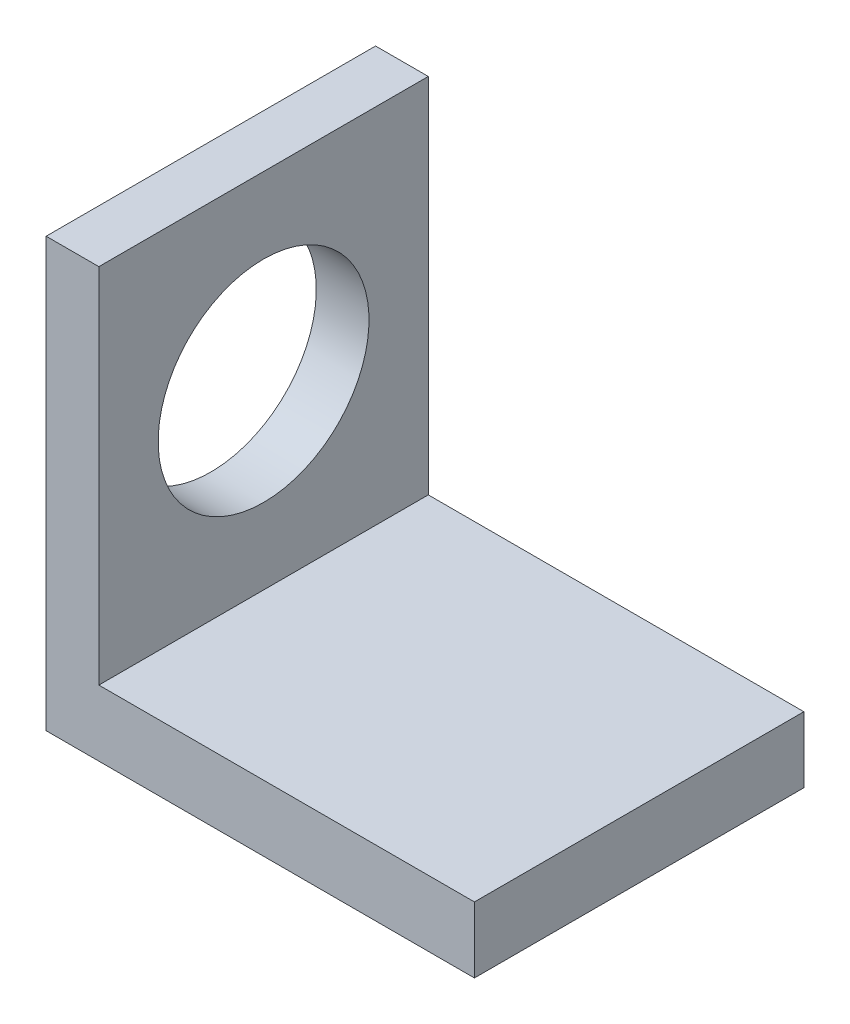
ISO-10303-21;
HEADER;
FILE_DESCRIPTION(('STEP AP214'),'2;1');
FILE_NAME('part.step','',(''),(''),'','','');
FILE_SCHEMA(('AUTOMOTIVE_DESIGN { 1 0 10303 214 1 1 1 1 }'));
ENDSEC;
DATA;
#1=APPLICATION_CONTEXT('core data for automotive mechanical design processes');
#2=APPLICATION_PROTOCOL_DEFINITION('international standard','automotive_design',2000,#1);
#3=PRODUCT_CONTEXT('',#1,'mechanical');
#4=PRODUCT('Part','Part','',(#3));
#5=PRODUCT_RELATED_PRODUCT_CATEGORY('part','',(#4));
#6=PRODUCT_DEFINITION_FORMATION('','',#4);
#7=PRODUCT_DEFINITION_CONTEXT('part definition',#1,'design');
#8=PRODUCT_DEFINITION('design','',#6,#7);
#9=PRODUCT_DEFINITION_SHAPE('','',#8);
#10=(LENGTH_UNIT() NAMED_UNIT(*) SI_UNIT(.MILLI.,.METRE.));
#11=(NAMED_UNIT(*) PLANE_ANGLE_UNIT() SI_UNIT($,.RADIAN.));
#12=(NAMED_UNIT(*) SI_UNIT($,.STERADIAN.) SOLID_ANGLE_UNIT());
#13=UNCERTAINTY_MEASURE_WITH_UNIT(LENGTH_MEASURE(1.E-05),#10,'distance_accuracy_value','');
#14=(GEOMETRIC_REPRESENTATION_CONTEXT(3) GLOBAL_UNCERTAINTY_ASSIGNED_CONTEXT((#13)) GLOBAL_UNIT_ASSIGNED_CONTEXT((#10,
#11,#12)) REPRESENTATION_CONTEXT('',''));
#15=CARTESIAN_POINT('',(0.,0.,0.));
#16=DIRECTION('',(0.,0.,1.));
#17=DIRECTION('',(1.,0.,0.));
#18=AXIS2_PLACEMENT_3D('',#15,#16,#17);
#19=CARTESIAN_POINT('',(0.,0.,-50.));
#20=DIRECTION('',(-1.,0.,0.));
#21=DIRECTION('',(0.,0.,1.));
#22=AXIS2_PLACEMENT_3D('',#19,#20,#21);
#23=PLANE('',#22);
#24=CARTESIAN_POINT('',(0.,37.5,-25.));
#25=DIRECTION('',(-1.,0.,0.));
#26=DIRECTION('',(0.,0.,1.));
#27=AXIS2_PLACEMENT_3D('',#24,#25,#26);
#28=CIRCLE('',#27,16.);
#29=CARTESIAN_POINT('',(0.,37.5,-9.));
#30=VERTEX_POINT('',#29);
#31=EDGE_CURVE('E122',#30,#30,#28,.T.);
#32=ORIENTED_EDGE('',*,*,#31,.F.);
#33=EDGE_LOOP('',(#32));
#34=FACE_BOUND('',#33,.T.);
#35=DIRECTION('',(0.,-1.,0.));
#36=VECTOR('',#35,1.);
#37=CARTESIAN_POINT('',(0.,0.,0.));
#38=LINE('',#37,#36);
#39=CARTESIAN_POINT('',(0.,65.,0.));
#40=VERTEX_POINT('',#39);
#41=CARTESIAN_POINT('',(0.,0.,0.));
#42=VERTEX_POINT('',#41);
#43=EDGE_CURVE('E118',#40,#42,#38,.T.);
#44=ORIENTED_EDGE('',*,*,#43,.F.);
#45=DIRECTION('',(0.,0.,1.));
#46=VECTOR('',#45,1.);
#47=CARTESIAN_POINT('',(0.,65.,-50.));
#48=LINE('',#47,#46);
#49=CARTESIAN_POINT('',(0.,65.,-50.));
#50=VERTEX_POINT('',#49);
#51=EDGE_CURVE('E11',#50,#40,#48,.T.);
#52=ORIENTED_EDGE('',*,*,#51,.F.);
#53=DIRECTION('',(0.,-1.,0.));
#54=VECTOR('',#53,1.);
#55=CARTESIAN_POINT('',(0.,0.,-50.));
#56=LINE('',#55,#54);
#57=CARTESIAN_POINT('',(0.,0.,-50.));
#58=VERTEX_POINT('',#57);
#59=EDGE_CURVE('E133',#50,#58,#56,.T.);
#60=ORIENTED_EDGE('',*,*,#59,.T.);
#61=DIRECTION('',(0.,0.,1.));
#62=VECTOR('',#61,1.);
#63=CARTESIAN_POINT('',(0.,0.,-50.));
#64=LINE('',#63,#62);
#65=EDGE_CURVE('E36',#58,#42,#64,.T.);
#66=ORIENTED_EDGE('',*,*,#65,.T.);
#67=EDGE_LOOP('',(#44,#52,#60,#66));
#68=FACE_BOUND('',#67,.T.);
#69=ADVANCED_FACE('F33',(#34,#68),#23,.T.);
#70=CARTESIAN_POINT('',(0.,65.,-50.));
#71=DIRECTION('',(0.,1.,0.));
#72=DIRECTION('',(0.,0.,1.));
#73=AXIS2_PLACEMENT_3D('',#70,#71,#72);
#74=PLANE('',#73);
#75=DIRECTION('',(-1.,0.,0.));
#76=VECTOR('',#75,1.);
#77=CARTESIAN_POINT('',(0.,65.,0.));
#78=LINE('',#77,#76);
#79=CARTESIAN_POINT('',(8.,65.,0.));
#80=VERTEX_POINT('',#79);
#81=EDGE_CURVE('E131',#80,#40,#78,.T.);
#82=ORIENTED_EDGE('',*,*,#81,.F.);
#83=DIRECTION('',(0.,0.,1.));
#84=VECTOR('',#83,1.);
#85=CARTESIAN_POINT('',(8.,65.,-50.));
#86=LINE('',#85,#84);
#87=CARTESIAN_POINT('',(8.,65.,-50.));
#88=VERTEX_POINT('',#87);
#89=EDGE_CURVE('E42',#88,#80,#86,.T.);
#90=ORIENTED_EDGE('',*,*,#89,.F.);
#91=DIRECTION('',(-1.,0.,0.));
#92=VECTOR('',#91,1.);
#93=CARTESIAN_POINT('',(0.,65.,-50.));
#94=LINE('',#93,#92);
#95=EDGE_CURVE('E108',#88,#50,#94,.T.);
#96=ORIENTED_EDGE('',*,*,#95,.T.);
#97=ORIENTED_EDGE('',*,*,#51,.T.);
#98=EDGE_LOOP('',(#82,#90,#96,#97));
#99=FACE_BOUND('',#98,.T.);
#100=ADVANCED_FACE('F141',(#99),#74,.T.);
#101=CARTESIAN_POINT('',(8.,65.,-50.));
#102=DIRECTION('',(1.,0.,0.));
#103=DIRECTION('',(0.,1.,0.));
#104=AXIS2_PLACEMENT_3D('',#101,#102,#103);
#105=PLANE('',#104);
#106=CARTESIAN_POINT('',(8.,37.5,-25.));
#107=DIRECTION('',(1.,0.,0.));
#108=DIRECTION('',(0.,1.,0.));
#109=AXIS2_PLACEMENT_3D('',#106,#107,#108);
#110=CIRCLE('',#109,16.);
#111=CARTESIAN_POINT('',(8.,53.5,-25.));
#112=VERTEX_POINT('',#111);
#113=EDGE_CURVE('E177',#112,#112,#110,.T.);
#114=ORIENTED_EDGE('',*,*,#113,.F.);
#115=EDGE_LOOP('',(#114));
#116=FACE_BOUND('',#115,.T.);
#117=DIRECTION('',(0.,1.,0.));
#118=VECTOR('',#117,1.);
#119=CARTESIAN_POINT('',(8.,65.,0.));
#120=LINE('',#119,#118);
#121=CARTESIAN_POINT('',(8.00000000000001,10.,0.));
#122=VERTEX_POINT('',#121);
#123=EDGE_CURVE('E95',#122,#80,#120,.T.);
#124=ORIENTED_EDGE('',*,*,#123,.F.);
#125=DIRECTION('',(0.,0.,1.));
#126=VECTOR('',#125,1.);
#127=CARTESIAN_POINT('',(8.00000000000001,10.,-50.));
#128=LINE('',#127,#126);
#129=CARTESIAN_POINT('',(8.00000000000001,10.,-50.));
#130=VERTEX_POINT('',#129);
#131=EDGE_CURVE('E90',#130,#122,#128,.T.);
#132=ORIENTED_EDGE('',*,*,#131,.F.);
#133=DIRECTION('',(0.,1.,0.));
#134=VECTOR('',#133,1.);
#135=CARTESIAN_POINT('',(8.,65.,-50.));
#136=LINE('',#135,#134);
#137=EDGE_CURVE('E93',#130,#88,#136,.T.);
#138=ORIENTED_EDGE('',*,*,#137,.T.);
#139=ORIENTED_EDGE('',*,*,#89,.T.);
#140=EDGE_LOOP('',(#124,#132,#138,#139));
#141=FACE_BOUND('',#140,.T.);
#142=ADVANCED_FACE('F92',(#116,#141),#105,.T.);
#143=CARTESIAN_POINT('',(8.00000000000001,10.,-50.));
#144=DIRECTION('',(0.,1.,0.));
#145=DIRECTION('',(-1.,0.,0.));
#146=AXIS2_PLACEMENT_3D('',#143,#144,#145);
#147=PLANE('',#146);
#148=DIRECTION('',(-1.,0.,0.));
#149=VECTOR('',#148,1.);
#150=CARTESIAN_POINT('',(8.00000000000001,10.,0.));
#151=LINE('',#150,#149);
#152=CARTESIAN_POINT('',(65.,10.,0.));
#153=VERTEX_POINT('',#152);
#154=EDGE_CURVE('E128',#153,#122,#151,.T.);
#155=ORIENTED_EDGE('',*,*,#154,.F.);
#156=DIRECTION('',(0.,0.,1.));
#157=VECTOR('',#156,1.);
#158=CARTESIAN_POINT('',(65.,10.,-50.));
#159=LINE('',#158,#157);
#160=CARTESIAN_POINT('',(65.,10.,-50.));
#161=VERTEX_POINT('',#160);
#162=EDGE_CURVE('E100',#161,#153,#159,.T.);
#163=ORIENTED_EDGE('',*,*,#162,.F.);
#164=DIRECTION('',(-1.,0.,0.));
#165=VECTOR('',#164,1.);
#166=CARTESIAN_POINT('',(8.00000000000001,10.,-50.));
#167=LINE('',#166,#165);
#168=EDGE_CURVE('E106',#161,#130,#167,.T.);
#169=ORIENTED_EDGE('',*,*,#168,.T.);
#170=ORIENTED_EDGE('',*,*,#131,.T.);
#171=EDGE_LOOP('',(#155,#163,#169,#170));
#172=FACE_BOUND('',#171,.T.);
#173=ADVANCED_FACE('F110',(#172),#147,.T.);
#174=CARTESIAN_POINT('',(65.,10.,-50.));
#175=DIRECTION('',(1.,0.,0.));
#176=DIRECTION('',(0.,1.,0.));
#177=AXIS2_PLACEMENT_3D('',#174,#175,#176);
#178=PLANE('',#177);
#179=DIRECTION('',(0.,1.,0.));
#180=VECTOR('',#179,1.);
#181=CARTESIAN_POINT('',(65.,10.,0.));
#182=LINE('',#181,#180);
#183=CARTESIAN_POINT('',(65.,0.,0.));
#184=VERTEX_POINT('',#183);
#185=EDGE_CURVE('E125',#184,#153,#182,.T.);
#186=ORIENTED_EDGE('',*,*,#185,.F.);
#187=DIRECTION('',(0.,0.,1.));
#188=VECTOR('',#187,1.);
#189=CARTESIAN_POINT('',(65.,0.,-50.));
#190=LINE('',#189,#188);
#191=CARTESIAN_POINT('',(65.,0.,-50.));
#192=VERTEX_POINT('',#191);
#193=EDGE_CURVE('E136',#192,#184,#190,.T.);
#194=ORIENTED_EDGE('',*,*,#193,.F.);
#195=DIRECTION('',(0.,1.,0.));
#196=VECTOR('',#195,1.);
#197=CARTESIAN_POINT('',(65.,10.,-50.));
#198=LINE('',#197,#196);
#199=EDGE_CURVE('E111',#192,#161,#198,.T.);
#200=ORIENTED_EDGE('',*,*,#199,.T.);
#201=ORIENTED_EDGE('',*,*,#162,.T.);
#202=EDGE_LOOP('',(#186,#194,#200,#201));
#203=FACE_BOUND('',#202,.T.);
#204=ADVANCED_FACE('F156',(#203),#178,.T.);
#205=CARTESIAN_POINT('',(65.,0.,-50.));
#206=DIRECTION('',(0.,-1.,0.));
#207=DIRECTION('',(1.,0.,0.));
#208=AXIS2_PLACEMENT_3D('',#205,#206,#207);
#209=PLANE('',#208);
#210=DIRECTION('',(1.,0.,0.));
#211=VECTOR('',#210,1.);
#212=CARTESIAN_POINT('',(65.,0.,0.));
#213=LINE('',#212,#211);
#214=EDGE_CURVE('E121',#42,#184,#213,.T.);
#215=ORIENTED_EDGE('',*,*,#214,.F.);
#216=ORIENTED_EDGE('',*,*,#65,.F.);
#217=DIRECTION('',(1.,0.,0.));
#218=VECTOR('',#217,1.);
#219=CARTESIAN_POINT('',(65.,0.,-50.));
#220=LINE('',#219,#218);
#221=EDGE_CURVE('E113',#58,#192,#220,.T.);
#222=ORIENTED_EDGE('',*,*,#221,.T.);
#223=ORIENTED_EDGE('',*,*,#193,.T.);
#224=EDGE_LOOP('',(#215,#216,#222,#223));
#225=FACE_BOUND('',#224,.T.);
#226=ADVANCED_FACE('F138',(#225),#209,.T.);
#227=CARTESIAN_POINT('',(0.,0.,-50.));
#228=DIRECTION('',(0.,0.,-1.));
#229=DIRECTION('',(-1.,0.,0.));
#230=AXIS2_PLACEMENT_3D('',#227,#228,#229);
#231=PLANE('',#230);
#232=ORIENTED_EDGE('',*,*,#59,.F.);
#233=ORIENTED_EDGE('',*,*,#95,.F.);
#234=ORIENTED_EDGE('',*,*,#137,.F.);
#235=ORIENTED_EDGE('',*,*,#168,.F.);
#236=ORIENTED_EDGE('',*,*,#199,.F.);
#237=ORIENTED_EDGE('',*,*,#221,.F.);
#238=EDGE_LOOP('',(#232,#233,#234,#235,#236,#237));
#239=FACE_BOUND('',#238,.T.);
#240=ADVANCED_FACE('F104',(#239),#231,.T.);
#241=CARTESIAN_POINT('',(0.,0.,0.));
#242=DIRECTION('',(0.,0.,-1.));
#243=DIRECTION('',(-1.,0.,0.));
#244=AXIS2_PLACEMENT_3D('',#241,#242,#243);
#245=PLANE('',#244);
#246=ORIENTED_EDGE('',*,*,#43,.T.);
#247=ORIENTED_EDGE('',*,*,#214,.T.);
#248=ORIENTED_EDGE('',*,*,#185,.T.);
#249=ORIENTED_EDGE('',*,*,#154,.T.);
#250=ORIENTED_EDGE('',*,*,#123,.T.);
#251=ORIENTED_EDGE('',*,*,#81,.T.);
#252=EDGE_LOOP('',(#246,#247,#248,#249,#250,#251));
#253=FACE_BOUND('',#252,.T.);
#254=ADVANCED_FACE('F140',(#253),#245,.F.);
#255=CARTESIAN_POINT('',(-42.,37.5,-25.));
#256=DIRECTION('',(1.,0.,0.));
#257=DIRECTION('',(0.,1.,0.));
#258=AXIS2_PLACEMENT_3D('',#255,#256,#257);
#259=CYLINDRICAL_SURFACE('',#258,16.);
#260=ORIENTED_EDGE('',*,*,#31,.T.);
#261=EDGE_LOOP('',(#260));
#262=FACE_BOUND('',#261,.T.);
#263=ORIENTED_EDGE('',*,*,#113,.T.);
#264=EDGE_LOOP('',(#263));
#265=FACE_BOUND('',#264,.T.);
#266=ADVANCED_FACE('F166',(#262,#265),#259,.F.);
#267=CLOSED_SHELL('',(#69,#100,#142,#173,#204,#226,#240,#254,#266));
#268=MANIFOLD_SOLID_BREP('B2',#267);
#269=ADVANCED_BREP_SHAPE_REPRESENTATION('',(#18,#268),#14);
#270=SHAPE_DEFINITION_REPRESENTATION(#9,#269);
ENDSEC;
END-ISO-10303-21;
